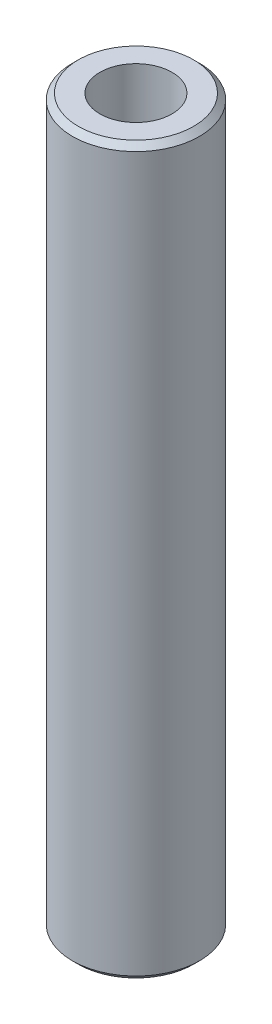
ISO-10303-21;
HEADER;
FILE_DESCRIPTION(('STEP AP214'),'2;1');
FILE_NAME('part.step','',(''),(''),'','','');
FILE_SCHEMA(('AUTOMOTIVE_DESIGN { 1 0 10303 214 1 1 1 1 }'));
ENDSEC;
DATA;
#1=APPLICATION_CONTEXT('core data for automotive mechanical design processes');
#2=APPLICATION_PROTOCOL_DEFINITION('international standard','automotive_design',2000,#1);
#3=PRODUCT_CONTEXT('',#1,'mechanical');
#4=PRODUCT('Part','Part','',(#3));
#5=PRODUCT_RELATED_PRODUCT_CATEGORY('part','',(#4));
#6=PRODUCT_DEFINITION_FORMATION('','',#4);
#7=PRODUCT_DEFINITION_CONTEXT('part definition',#1,'design');
#8=PRODUCT_DEFINITION('design','',#6,#7);
#9=PRODUCT_DEFINITION_SHAPE('','',#8);
#10=(LENGTH_UNIT() NAMED_UNIT(*) SI_UNIT(.MILLI.,.METRE.));
#11=(NAMED_UNIT(*) PLANE_ANGLE_UNIT() SI_UNIT($,.RADIAN.));
#12=(NAMED_UNIT(*) SI_UNIT($,.STERADIAN.) SOLID_ANGLE_UNIT());
#13=UNCERTAINTY_MEASURE_WITH_UNIT(LENGTH_MEASURE(1.E-05),#10,'distance_accuracy_value','');
#14=(GEOMETRIC_REPRESENTATION_CONTEXT(3) GLOBAL_UNCERTAINTY_ASSIGNED_CONTEXT((#13)) GLOBAL_UNIT_ASSIGNED_CONTEXT((#10,
#11,#12)) REPRESENTATION_CONTEXT('',''));
#15=CARTESIAN_POINT('',(0.,0.,0.));
#16=DIRECTION('',(0.,0.,1.));
#17=DIRECTION('',(1.,0.,0.));
#18=AXIS2_PLACEMENT_3D('',#15,#16,#17);
#19=CARTESIAN_POINT('',(0.,600.,0.));
#20=DIRECTION('',(0.,-1.,0.));
#21=DIRECTION('',(0.,0.,-1.));
#22=AXIS2_PLACEMENT_3D('',#19,#20,#21);
#23=CYLINDRICAL_SURFACE('',#22,52.5);
#24=CARTESIAN_POINT('',(0.,595.195029806555,0.));
#25=DIRECTION('',(0.,1.,0.));
#26=DIRECTION('',(0.,0.,1.));
#27=AXIS2_PLACEMENT_3D('',#24,#25,#26);
#28=CIRCLE('',#27,52.5);
#29=CARTESIAN_POINT('',(0.,595.195029806555,52.5));
#30=VERTEX_POINT('',#29);
#31=EDGE_CURVE('E50',#30,#30,#28,.F.);
#32=ORIENTED_EDGE('',*,*,#31,.T.);
#33=EDGE_LOOP('',(#32));
#34=FACE_BOUND('',#33,.T.);
#35=CARTESIAN_POINT('',(0.,4.80497019344517,0.));
#36=DIRECTION('',(0.,1.,0.));
#37=DIRECTION('',(0.,0.,1.));
#38=AXIS2_PLACEMENT_3D('',#35,#36,#37);
#39=CIRCLE('',#38,52.5);
#40=CARTESIAN_POINT('',(0.,4.80497019344517,52.5));
#41=VERTEX_POINT('',#40);
#42=EDGE_CURVE('E51',#41,#41,#39,.T.);
#43=ORIENTED_EDGE('',*,*,#42,.T.);
#44=EDGE_LOOP('',(#43));
#45=FACE_BOUND('',#44,.T.);
#46=ADVANCED_FACE('F39',(#34,#45),#23,.T.);
#47=CARTESIAN_POINT('',(0.,600.,0.));
#48=DIRECTION('',(0.,1.,0.));
#49=DIRECTION('',(0.,0.,1.));
#50=AXIS2_PLACEMENT_3D('',#47,#48,#49);
#51=PLANE('',#50);
#52=CARTESIAN_POINT('',(0.,600.,0.));
#53=DIRECTION('',(0.,1.,0.));
#54=DIRECTION('',(0.,0.,1.));
#55=AXIS2_PLACEMENT_3D('',#52,#53,#54);
#56=CIRCLE('',#55,47.6950298065548);
#57=CARTESIAN_POINT('',(0.,600.,47.6950298065548));
#58=VERTEX_POINT('',#57);
#59=EDGE_CURVE('E54',#58,#58,#56,.T.);
#60=ORIENTED_EDGE('',*,*,#59,.T.);
#61=EDGE_LOOP('',(#60));
#62=FACE_BOUND('',#61,.T.);
#63=CARTESIAN_POINT('',(0.,600.,0.));
#64=DIRECTION('',(0.,1.,0.));
#65=DIRECTION('',(0.,0.,1.));
#66=AXIS2_PLACEMENT_3D('',#63,#64,#65);
#67=CIRCLE('',#66,29.8314451674);
#68=CARTESIAN_POINT('',(0.,600.,29.8314451674));
#69=VERTEX_POINT('',#68);
#70=EDGE_CURVE('E58',#69,#69,#67,.T.);
#71=ORIENTED_EDGE('',*,*,#70,.F.);
#72=EDGE_LOOP('',(#71));
#73=FACE_BOUND('',#72,.T.);
#74=ADVANCED_FACE('F69',(#62,#73),#51,.T.);
#75=CARTESIAN_POINT('',(0.,0.,0.));
#76=DIRECTION('',(0.,1.,0.));
#77=DIRECTION('',(0.,0.,1.));
#78=AXIS2_PLACEMENT_3D('',#75,#76,#77);
#79=PLANE('',#78);
#80=CARTESIAN_POINT('',(0.,0.,0.));
#81=DIRECTION('',(0.,1.,0.));
#82=DIRECTION('',(0.,0.,1.));
#83=AXIS2_PLACEMENT_3D('',#80,#81,#82);
#84=CIRCLE('',#83,47.6950298065547);
#85=CARTESIAN_POINT('',(0.,0.,47.6950298065547));
#86=VERTEX_POINT('',#85);
#87=EDGE_CURVE('E10',#86,#86,#84,.F.);
#88=ORIENTED_EDGE('',*,*,#87,.T.);
#89=EDGE_LOOP('',(#88));
#90=FACE_BOUND('',#89,.T.);
#91=CARTESIAN_POINT('',(0.,0.,0.));
#92=DIRECTION('',(0.,1.,0.));
#93=DIRECTION('',(0.,0.,1.));
#94=AXIS2_PLACEMENT_3D('',#91,#92,#93);
#95=CIRCLE('',#94,29.8314451674);
#96=CARTESIAN_POINT('',(0.,0.,29.8314451674));
#97=VERTEX_POINT('',#96);
#98=EDGE_CURVE('E63',#97,#97,#95,.T.);
#99=ORIENTED_EDGE('',*,*,#98,.T.);
#100=EDGE_LOOP('',(#99));
#101=FACE_BOUND('',#100,.T.);
#102=ADVANCED_FACE('F75',(#90,#101),#79,.F.);
#103=CARTESIAN_POINT('',(0.,600.,0.));
#104=DIRECTION('',(0.,-1.,0.));
#105=DIRECTION('',(0.,0.,-1.));
#106=AXIS2_PLACEMENT_3D('',#103,#104,#105);
#107=CYLINDRICAL_SURFACE('',#106,29.8314451674);
#108=ORIENTED_EDGE('',*,*,#70,.T.);
#109=EDGE_LOOP('',(#108));
#110=FACE_BOUND('',#109,.T.);
#111=ORIENTED_EDGE('',*,*,#98,.F.);
#112=EDGE_LOOP('',(#111));
#113=FACE_BOUND('',#112,.T.);
#114=ADVANCED_FACE('F70',(#110,#113),#107,.F.);
#115=CARTESIAN_POINT('',(0.,600.,0.));
#116=DIRECTION('',(0.,-1.,0.));
#117=DIRECTION('',(0.,0.,-1.));
#118=AXIS2_PLACEMENT_3D('',#115,#116,#117);
#119=CONICAL_SURFACE('',#118,47.6950298065548,0.785398163397444);
#120=ORIENTED_EDGE('',*,*,#31,.F.);
#121=EDGE_LOOP('',(#120));
#122=FACE_BOUND('',#121,.T.);
#123=ORIENTED_EDGE('',*,*,#59,.F.);
#124=EDGE_LOOP('',(#123));
#125=FACE_BOUND('',#124,.T.);
#126=ADVANCED_FACE('F81',(#122,#125),#119,.T.);
#127=CARTESIAN_POINT('',(0.,4.80497019344517,0.));
#128=DIRECTION('',(0.,1.,0.));
#129=DIRECTION('',(0.,0.,1.));
#130=AXIS2_PLACEMENT_3D('',#127,#128,#129);
#131=CONICAL_SURFACE('',#130,52.5,0.785398163397461);
#132=ORIENTED_EDGE('',*,*,#87,.F.);
#133=EDGE_LOOP('',(#132));
#134=FACE_BOUND('',#133,.T.);
#135=ORIENTED_EDGE('',*,*,#42,.F.);
#136=EDGE_LOOP('',(#135));
#137=FACE_BOUND('',#136,.T.);
#138=ADVANCED_FACE('F45',(#134,#137),#131,.T.);
#139=CLOSED_SHELL('',(#46,#74,#102,#114,#126,#138));
#140=MANIFOLD_SOLID_BREP('B2',#139);
#141=ADVANCED_BREP_SHAPE_REPRESENTATION('',(#18,#140),#14);
#142=SHAPE_DEFINITION_REPRESENTATION(#9,#141);
ENDSEC;
END-ISO-10303-21;
